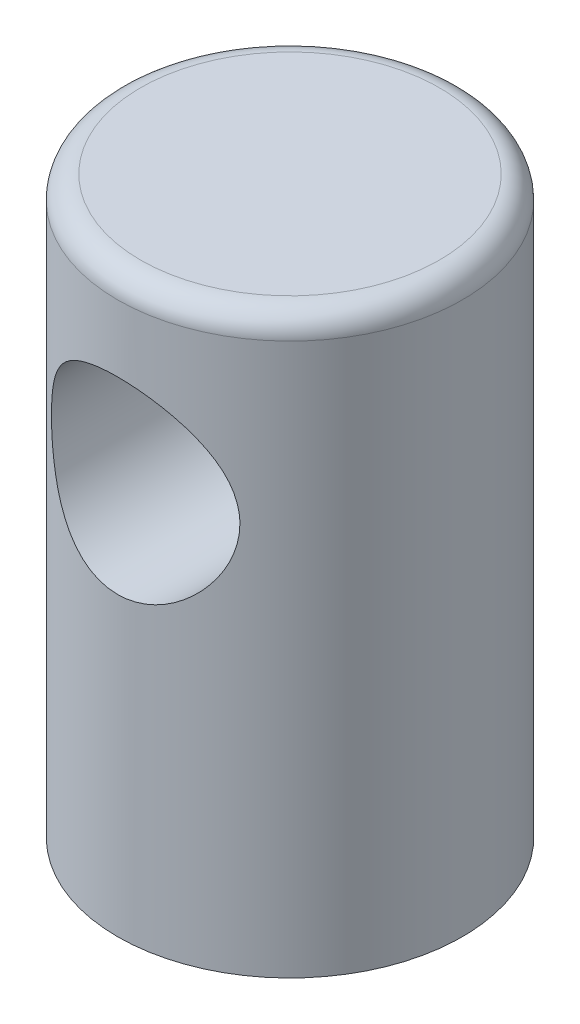
ISO-10303-21;
HEADER;
FILE_DESCRIPTION(('STEP AP214'),'2;1');
FILE_NAME('part.step','',(''),(''),'','','');
FILE_SCHEMA(('AUTOMOTIVE_DESIGN { 1 0 10303 214 1 1 1 1 }'));
ENDSEC;
DATA;
#1=APPLICATION_CONTEXT('core data for automotive mechanical design processes');
#2=APPLICATION_PROTOCOL_DEFINITION('international standard','automotive_design',2000,#1);
#3=PRODUCT_CONTEXT('',#1,'mechanical');
#4=PRODUCT('Part','Part','',(#3));
#5=PRODUCT_RELATED_PRODUCT_CATEGORY('part','',(#4));
#6=PRODUCT_DEFINITION_FORMATION('','',#4);
#7=PRODUCT_DEFINITION_CONTEXT('part definition',#1,'design');
#8=PRODUCT_DEFINITION('design','',#6,#7);
#9=PRODUCT_DEFINITION_SHAPE('','',#8);
#10=(LENGTH_UNIT() NAMED_UNIT(*) SI_UNIT(.MILLI.,.METRE.));
#11=(NAMED_UNIT(*) PLANE_ANGLE_UNIT() SI_UNIT($,.RADIAN.));
#12=(NAMED_UNIT(*) SI_UNIT($,.STERADIAN.) SOLID_ANGLE_UNIT());
#13=UNCERTAINTY_MEASURE_WITH_UNIT(LENGTH_MEASURE(1.E-05),#10,'distance_accuracy_value','');
#14=(GEOMETRIC_REPRESENTATION_CONTEXT(3) GLOBAL_UNCERTAINTY_ASSIGNED_CONTEXT((#13)) GLOBAL_UNIT_ASSIGNED_CONTEXT((#10,
#11,#12)) REPRESENTATION_CONTEXT('',''));
#15=CARTESIAN_POINT('',(0.,0.,0.));
#16=DIRECTION('',(0.,0.,1.));
#17=DIRECTION('',(1.,0.,0.));
#18=AXIS2_PLACEMENT_3D('',#15,#16,#17);
#19=CARTESIAN_POINT('',(0.,25.,0.));
#20=DIRECTION('',(0.,-1.,0.));
#21=DIRECTION('',(0.,0.,-1.));
#22=AXIS2_PLACEMENT_3D('',#19,#20,#21);
#23=CYLINDRICAL_SURFACE('',#22,7.5);
#24=CARTESIAN_POINT('',(0.,21.1,-7.5));
#25=CARTESIAN_POINT('',(-0.106573934645957,21.1000009084265,-7.50000081273061));
#26=CARTESIAN_POINT('',(-0.21313643870769,21.0958405152783,-7.49772377945524));
#27=CARTESIAN_POINT('',(-0.42545927593668,21.0792555400362,-7.48867657263857));
#28=CARTESIAN_POINT('',(-0.531219354622428,21.0668284386434,-7.48190502938608));
#29=CARTESIAN_POINT('',(-0.741201686015011,21.0338471322813,-7.46402902384523));
#30=CARTESIAN_POINT('',(-0.845422314838075,21.0132849039522,-7.45292028409107));
#31=CARTESIAN_POINT('',(-1.05149054209101,20.9642912711127,-7.42665368948545));
#32=CARTESIAN_POINT('',(-1.15333715280993,20.9358566524836,-7.41149418088507));
#33=CARTESIAN_POINT('',(-1.45336228932745,20.8394833617792,-7.36061207090714));
#34=CARTESIAN_POINT('',(-1.6471315139373,20.7602977559572,-7.31938607661403));
#35=CARTESIAN_POINT('',(-2.01814422803057,20.5749427815982,-7.22591398036082));
#36=CARTESIAN_POINT('',(-2.19538713348771,20.4687724599376,-7.17366748915825));
#37=CARTESIAN_POINT('',(-2.54206643368703,20.2242630954792,-7.05857316252065));
#38=CARTESIAN_POINT('',(-2.71014419755537,20.0842229595317,-6.99524512804682));
#39=CARTESIAN_POINT('',(-3.02169124467197,19.7797400914424,-6.86643091048839));
#40=CARTESIAN_POINT('',(-3.16513781608967,19.6152750954988,-6.800942801263));
#41=CARTESIAN_POINT('',(-3.43749462557373,19.2474062808724,-6.66774081052148));
#42=CARTESIAN_POINT('',(-3.5636437797434,19.0417726201787,-6.60042754580275));
#43=CARTESIAN_POINT('',(-3.72514523092172,18.716961963344,-6.50977160683407));
#44=CARTESIAN_POINT('',(-3.77437025724054,18.6059259575621,-6.48126429955823));
#45=CARTESIAN_POINT('',(-3.86304843332249,18.3790088454147,-6.42880292543978));
#46=CARTESIAN_POINT('',(-3.90250787075144,18.2631309130482,-6.40484593115852));
#47=CARTESIAN_POINT('',(-3.9689544618329,18.0347243603468,-6.36386921736729));
#48=CARTESIAN_POINT('',(-3.99656655992672,17.9224384145173,-6.34650972759967));
#49=CARTESIAN_POINT('',(-4.04227688695904,17.6952748011341,-6.31749422245027));
#50=CARTESIAN_POINT('',(-4.06038068766294,17.5803986926457,-6.30583486712543));
#51=CARTESIAN_POINT('',(-4.0867604515431,17.3491664046681,-6.28877077393339));
#52=CARTESIAN_POINT('',(-4.09504554900184,17.2328117027396,-6.2833602229594));
#53=CARTESIAN_POINT('',(-4.10165713604334,16.9997073154125,-6.27904659698444));
#54=CARTESIAN_POINT('',(-4.09998495517393,16.8829576848274,-6.28014265318722));
#55=CARTESIAN_POINT('',(-4.08771668911804,16.6677677411385,-6.28813268276836));
#56=CARTESIAN_POINT('',(-4.07849929834302,16.5692123114394,-6.29413069222198));
#57=CARTESIAN_POINT('',(-4.0530370510353,16.3733773579762,-6.31055560290412));
#58=CARTESIAN_POINT('',(-4.03679005130766,16.27609823266,-6.32098385481227));
#59=CARTESIAN_POINT('',(-3.97777985856741,15.9871688124785,-6.35841973299225));
#60=CARTESIAN_POINT('',(-3.92474025260353,15.7983052205248,-6.39158364896371));
#61=CARTESIAN_POINT('',(-3.79209359792903,15.4285201323808,-6.47117168971868));
#62=CARTESIAN_POINT('',(-3.71193334073884,15.2478610259368,-6.51786875836482));
#63=CARTESIAN_POINT('',(-3.52777152787463,14.9015970095795,-6.6193559642557));
#64=CARTESIAN_POINT('',(-3.42375961453357,14.7359986836239,-6.67414961378263));
#65=CARTESIAN_POINT('',(-3.17609370087732,14.3974972653392,-6.79590344199827));
#66=CARTESIAN_POINT('',(-3.02878986127582,14.2274656991037,-6.86343023779544));
#67=CARTESIAN_POINT('',(-2.70769830740109,13.9131227758866,-6.99632096513092));
#68=CARTESIAN_POINT('',(-2.5338930199075,13.7688286242763,-7.06168342622426));
#69=CARTESIAN_POINT('',(-2.2497152261565,13.5702265169763,-7.15539417267725));
#70=CARTESIAN_POINT('',(-2.14758376702382,13.5053454815625,-7.18678317121193));
#71=CARTESIAN_POINT('',(-1.93727667547434,13.3845268698248,-7.24630087847473));
#72=CARTESIAN_POINT('',(-1.82910365097962,13.3285854742415,-7.27443097807352));
#73=CARTESIAN_POINT('',(-1.60744280854174,13.2262719186545,-7.32660146651892));
#74=CARTESIAN_POINT('',(-1.49395766278402,13.1798950095172,-7.35064388400968));
#75=CARTESIAN_POINT('',(-1.26246903380229,13.0972744298367,-7.39391822780208));
#76=CARTESIAN_POINT('',(-1.14446618750206,13.0610293368068,-7.4131508293523));
#77=CARTESIAN_POINT('',(-0.916038618776326,13.0020663425066,-7.44465668014707));
#78=CARTESIAN_POINT('',(-0.805922289220479,12.9784074381309,-7.45740904070198));
#79=CARTESIAN_POINT('',(-0.583678307633231,12.9401935380569,-7.47808593544327));
#80=CARTESIAN_POINT('',(-0.471550883834909,12.9256375159407,-7.4860110139391));
#81=CARTESIAN_POINT('',(-0.246289701471043,12.905843346615,-7.49680263716242));
#82=CARTESIAN_POINT('',(-0.133156471867724,12.9006005627182,-7.49967169907183));
#83=CARTESIAN_POINT('',(0.0931645265132909,12.8994969595474,-7.50027498897887));
#84=CARTESIAN_POINT('',(0.20635229139722,12.9036355480345,-7.49800954111423));
#85=CARTESIAN_POINT('',(0.420883852265761,12.9203816672955,-7.48887452246084));
#86=CARTESIAN_POINT('',(0.522315283580152,12.9321322258077,-7.48247098770682));
#87=CARTESIAN_POINT('',(0.723709026069785,12.9630899592273,-7.46568687319145));
#88=CARTESIAN_POINT('',(0.823670870401515,12.9822994526701,-7.45530505683426));
#89=CARTESIAN_POINT('',(1.1202726387825,13.050814705433,-7.4185258095444));
#90=CARTESIAN_POINT('',(1.31382111277914,13.1110227010056,-7.38648575645142));
#91=CARTESIAN_POINT('',(1.69203293829092,13.2597658828877,-7.30925736325514));
#92=CARTESIAN_POINT('',(1.87638964891696,13.3489205950182,-7.26378363004543));
#93=CARTESIAN_POINT('',(2.22804519050804,13.5522333954873,-7.16374611925089));
#94=CARTESIAN_POINT('',(2.39533766397102,13.666400753106,-7.10917897359429));
#95=CARTESIAN_POINT('',(2.72788444224418,13.9310142193291,-6.98879751170646));
#96=CARTESIAN_POINT('',(2.89084661006226,14.0840819197866,-6.92240718582408));
#97=CARTESIAN_POINT('',(3.18999655715162,14.4147048881482,-6.78975334645223));
#98=CARTESIAN_POINT('',(3.32615703363743,14.5922848165729,-6.72349002967776));
#99=CARTESIAN_POINT('',(3.5779773910981,14.983555235117,-6.59315512249784));
#100=CARTESIAN_POINT('',(3.6913102726195,15.1989605133091,-6.52962763278148));
#101=CARTESIAN_POINT('',(3.83206223254979,15.53704232929,-6.44734482529256));
#102=CARTESIAN_POINT('',(3.87410648960241,15.6522386184694,-6.42208426963096));
#103=CARTESIAN_POINT('',(3.94791669858315,15.8868767262061,-6.3769763697226));
#104=CARTESIAN_POINT('',(3.97968981351563,16.0063155212795,-6.35712525450336));
#105=CARTESIAN_POINT('',(4.02987677292,16.2367026524413,-6.3254159785764));
#106=CARTESIAN_POINT('',(4.04928574440992,16.3473543615919,-6.3129702987991));
#107=CARTESIAN_POINT('',(4.07897160313283,16.5703182837527,-6.2938307428021));
#108=CARTESIAN_POINT('',(4.08925363038747,16.6826295258834,-6.28713362923229));
#109=CARTESIAN_POINT('',(4.10051468051794,16.9078646555059,-6.27979499366913));
#110=CARTESIAN_POINT('',(4.10149791776983,17.0207882422511,-6.27915072841876));
#111=CARTESIAN_POINT('',(4.09415457213973,17.2461953992695,-6.28394125870003));
#112=CARTESIAN_POINT('',(4.08582872360662,17.3586790035485,-6.28937557472173));
#113=CARTESIAN_POINT('',(4.06174469156724,17.5672110689171,-6.30495065108804));
#114=CARTESIAN_POINT('',(4.04712758332972,17.6634482440443,-6.31436594760982));
#115=CARTESIAN_POINT('',(4.0112082194745,17.8541894256803,-6.33724359779072));
#116=CARTESIAN_POINT('',(3.98990381764242,17.9486928654448,-6.35070725066749));
#117=CARTESIAN_POINT('',(3.91629957455314,18.2287354062152,-6.39656008180941));
#118=CARTESIAN_POINT('',(3.85429487747422,18.4109234215033,-6.43442065527917));
#119=CARTESIAN_POINT('',(3.70210964456735,18.7735546530895,-6.52323236641775));
#120=CARTESIAN_POINT('',(3.61042068900943,18.9531895229154,-6.5748495271991));
#121=CARTESIAN_POINT('',(3.40288370714911,19.2957587536496,-6.68462110477707));
#122=CARTESIAN_POINT('',(3.28702279844064,19.4586841399209,-6.74277899979906));
#123=CARTESIAN_POINT('',(3.01363276757207,19.7894291386724,-6.86979620153756));
#124=CARTESIAN_POINT('',(2.85243217209656,19.954120759932,-6.93892141949679));
#125=CARTESIAN_POINT('',(2.50331464455675,20.2552250931335,-7.07235888995773));
#126=CARTESIAN_POINT('',(2.31537908497068,20.3916179236788,-7.13666773857178));
#127=CARTESIAN_POINT('',(2.01315638681485,20.5737501335376,-7.22556494181149));
#128=CARTESIAN_POINT('',(1.90714484403668,20.6314544743746,-7.25433481694938));
#129=CARTESIAN_POINT('',(1.68967428667309,20.7375951360165,-7.30804452739231));
#130=CARTESIAN_POINT('',(1.57821798059042,20.786036007174,-7.33298624195143));
#131=CARTESIAN_POINT('',(1.35084505163158,20.8729841519862,-7.37825401130925));
#132=CARTESIAN_POINT('',(1.2349375462314,20.9115106040874,-7.39858896815343));
#133=CARTESIAN_POINT('',(0.999458944027171,20.9781961289026,-7.43405989622318));
#134=CARTESIAN_POINT('',(0.879889824684756,21.0063606942321,-7.44919862157415));
#135=CARTESIAN_POINT('',(0.634386812688221,21.0526082642012,-7.47417164899619));
#136=CARTESIAN_POINT('',(0.508370471085667,21.0703522060321,-7.4838272462866));
#137=CARTESIAN_POINT('',(0.254897297231694,21.0940474849499,-7.49674091099307));
#138=CARTESIAN_POINT('',(0.127440476185957,21.099998913709,-7.49999902814158));
#139=CARTESIAN_POINT('',(0.,21.1,-7.5));
#140=B_SPLINE_CURVE_WITH_KNOTS('',3,(#24,#25,#26,#27,#28,#29,#30,#31,#32,#33,#34,#35,#36,#37,
#38,#39,#40,#41,#42,#43,#44,#45,#46,#47,#48,#49,#50,#51,#52,#53,#54,#55,#56,#57,#58,#59,#60,#61,
#62,#63,#64,#65,#66,#67,#68,#69,#70,#71,#72,#73,#74,#75,#76,#77,#78,#79,#80,#81,#82,#83,#84,#85,
#86,#87,#88,#89,#90,#91,#92,#93,#94,#95,#96,#97,#98,#99,#100,#101,#102,#103,#104,#105,#106,#107,
#108,#109,#110,#111,#112,#113,#114,#115,#116,#117,#118,#119,#120,#121,#122,#123,#124,#125,#126,
#127,#128,#129,#130,#131,#132,#133,#134,#135,#136,#137,#138,#139),.UNSPECIFIED.,.T.,.F.,(4,2,2,
2,2,2,2,2,2,2,2,2,2,2,2,2,2,2,2,2,2,2,2,2,2,2,2,2,2,2,2,2,2,2,2,2,2,2,2,2,2,2,2,2,2,2,2,2,2,2,2,
2,2,2,2,2,2,4),(0.,0.319596678541733,0.639290799577186,0.959301011673195,1.2794420698566,
1.91639516761656,2.55337076624139,3.23382448744707,3.9149023081272,4.66206671211769,
5.03589413847789,5.40948024267271,5.7597387557395,6.10979179123826,6.45951891816062,
6.80919934873634,7.10633553893022,7.40356238423946,7.9976559280753,8.60468221402115,
9.2119726041664,9.91374072303406,10.615976227406,10.9905581212694,11.3649795531434,
11.7392146204379,12.1133971194545,12.4529754185827,12.7925154208166,13.131886332293,
13.4712358201357,13.7777948862706,14.0844493196053,14.6971859502687,15.324011938395,
15.9510706121555,16.6478078226179,17.3452511646969,18.0954033698558,18.4705204505624,
18.8453753606971,19.1839614036863,19.5223566439579,19.8605985101693,20.1988136959938,
20.4918605797136,20.7850016099821,21.3709341102879,21.9931905299081,22.615779431209,
23.3344908881185,24.0537055807215,24.4255096872706,24.7971306863833,25.1680273247614,
25.538727074499,25.9209018497986,26.3030736541532),.UNSPECIFIED.);
#141=CARTESIAN_POINT('',(0.,21.1,-7.5));
#142=VERTEX_POINT('',#141);
#143=EDGE_CURVE('E11',#142,#142,#140,.T.);
#144=ORIENTED_EDGE('',*,*,#143,.T.);
#145=EDGE_LOOP('',(#144));
#146=FACE_BOUND('',#145,.T.);
#147=CARTESIAN_POINT('',(4.1,17.,6.28012738724303));
#148=CARTESIAN_POINT('',(4.10000093002348,16.8947668881671,6.28012612742238));
#149=CARTESIAN_POINT('',(4.09594359663583,16.789544471863,6.28278107655353));
#150=CARTESIAN_POINT('',(4.07978004523093,16.5799454707598,6.29328917379422));
#151=CARTESIAN_POINT('',(4.0676711131229,16.4755691831927,6.30114407473698));
#152=CARTESIAN_POINT('',(4.03556208672876,16.2684006736593,6.32175621425818));
#153=CARTESIAN_POINT('',(4.01555240256419,16.1656105350895,6.33451940999906));
#154=CARTESIAN_POINT('',(3.96792069657193,15.962450018736,6.36446311913343));
#155=CARTESIAN_POINT('',(3.94029527548137,15.8620807433044,6.38164560483449));
#156=CARTESIAN_POINT('',(3.84688424959316,15.5668846935001,6.43869656140272));
#157=CARTESIAN_POINT('',(3.77032160656169,15.3764480139658,6.48423444926833));
#158=CARTESIAN_POINT('',(3.59117414567328,15.0112977961189,6.58513356407885));
#159=CARTESIAN_POINT('',(3.48858413072552,14.8365874074494,6.64049675225485));
#160=CARTESIAN_POINT('',(3.24832878098852,14.4885428832786,6.76152426532025));
#161=CARTESIAN_POINT('',(3.10818539837053,14.317084561435,6.82766525826985));
#162=CARTESIAN_POINT('',(2.80180008146181,13.9985446210087,6.95899755732466));
#163=CARTESIAN_POINT('',(2.63554282752463,13.8514774162023,7.02418828126847));
#164=CARTESIAN_POINT('',(2.36132120773385,13.6460902265034,7.11931441764812));
#165=CARTESIAN_POINT('',(2.26144791580563,13.5779316301487,7.15174434363931));
#166=CARTESIAN_POINT('',(2.0554148745458,13.4503615729961,7.21365490826196));
#167=CARTESIAN_POINT('',(1.94925770322166,13.3909465594797,7.24313674320122));
#168=CARTESIAN_POINT('',(1.73132104263363,13.2814794830552,7.29829854016738));
#169=CARTESIAN_POINT('',(1.61954346052907,13.231424270955,7.32397978033098));
#170=CARTESIAN_POINT('',(1.39112250354381,13.1412635907747,7.37077746349993));
#171=CARTESIAN_POINT('',(1.27447976908253,13.1011568179402,7.39189450506083));
#172=CARTESIAN_POINT('',(1.04705225639775,13.0343284352602,7.42736951287102));
#173=CARTESIAN_POINT('',(0.936575549191747,13.0067768173747,7.44214075011331));
#174=CARTESIAN_POINT('',(0.713197049439393,12.9608978422434,7.46685822279571));
#175=CARTESIAN_POINT('',(0.600295549311174,12.9425693791711,7.47680503666349));
#176=CARTESIAN_POINT('',(0.373089778895296,12.9154086968346,7.49157901174382));
#177=CARTESIAN_POINT('',(0.258786378935841,12.906570860242,7.49640920136975));
#178=CARTESIAN_POINT('',(0.0297451936071894,12.8985069600318,7.50081552628574));
#179=CARTESIAN_POINT('',(-0.0849925572451534,12.8992801480382,7.5003920706583));
#180=CARTESIAN_POINT('',(-0.301973410365606,12.9098469342542,7.49462039538139));
#181=CARTESIAN_POINT('',(-0.40427722763431,12.9186958876674,7.48978792630472));
#182=CARTESIAN_POINT('',(-0.607673169264992,12.9439853644267,7.47603835925916));
#183=CARTESIAN_POINT('',(-0.708764907864702,12.9604282421298,7.46711999454001));
#184=CARTESIAN_POINT('',(-1.00909210964698,13.0208888185037,7.43452185683212));
#185=CARTESIAN_POINT('',(-1.20558214800269,13.0760487591009,7.40499307451031));
#186=CARTESIAN_POINT('',(-1.58807689391617,13.2145105209361,7.33256019619329));
#187=CARTESIAN_POINT('',(-1.77394206831017,13.2981159905432,7.28951218461427));
#188=CARTESIAN_POINT('',(-2.12940164615156,13.4905105022637,7.19371631807302));
#189=CARTESIAN_POINT('',(-2.298990765565,13.5993076840286,7.14096532913332));
#190=CARTESIAN_POINT('',(-2.6364597751998,13.8522736653664,7.02383812157043));
#191=CARTESIAN_POINT('',(-2.80221477080394,13.998981730383,6.95882194607267));
#192=CARTESIAN_POINT('',(-3.10800752779965,14.3168936589683,6.82773935603272));
#193=CARTESIAN_POINT('',(-3.24801896018513,14.4881222859421,6.76167194053228));
#194=CARTESIAN_POINT('',(-3.51042960397764,14.8682032370832,6.62950129175416));
#195=CARTESIAN_POINT('',(-3.6302765150503,15.0790252082404,6.5638841901));
#196=CARTESIAN_POINT('',(-3.78151167047837,15.4109757554452,6.4771567152707));
#197=CARTESIAN_POINT('',(-3.82717306027364,15.524266922624,6.45019352693943));
#198=CARTESIAN_POINT('',(-3.90844971616798,15.7554131883302,6.40127099147903));
#199=CARTESIAN_POINT('',(-3.94407175251152,15.8732651499012,6.3793082741091));
#200=CARTESIAN_POINT('',(-4.00228205551416,16.1029862264195,6.34293480689148));
#201=CARTESIAN_POINT('',(-4.0256876853828,16.2145750544872,6.32805900639557));
#202=CARTESIAN_POINT('',(-4.06316133846621,16.4398687480593,6.30406359751327));
#203=CARTESIAN_POINT('',(-4.07723473963101,16.5535723559548,6.29494067402429));
#204=CARTESIAN_POINT('',(-4.09580313362994,16.7820091554196,6.28287519043653));
#205=CARTESIAN_POINT('',(-4.10030472440854,16.896741582995,6.2799283731062));
#206=CARTESIAN_POINT('',(-4.09966329441545,17.1261601791551,6.28034728091182));
#207=CARTESIAN_POINT('',(-4.09452129040506,17.2408463513415,6.28371234056228));
#208=CARTESIAN_POINT('',(-4.07611387812923,17.4526873481902,6.29566464834979));
#209=CARTESIAN_POINT('',(-4.06411678345451,17.5500015195397,6.30343533291544));
#210=CARTESIAN_POINT('',(-4.03328116882656,17.743113483076,6.32320897197404));
#211=CARTESIAN_POINT('',(-4.01444056463844,17.8389108040104,6.33521321579232));
#212=CARTESIAN_POINT('',(-3.94796393674734,18.1231036661807,6.37701912464347));
#213=CARTESIAN_POINT('',(-3.89036264928045,18.3084166712026,6.41262127203169));
#214=CARTESIAN_POINT('',(-3.74789075804152,18.6743940548848,6.49695236128483));
#215=CARTESIAN_POINT('',(-3.66196201160869,18.8545231869117,6.54617634763405));
#216=CARTESIAN_POINT('',(-3.46612605894499,19.1989149175086,6.65194323265548));
#217=CARTESIAN_POINT('',(-3.35620690614238,19.3631695520017,6.70848977203471));
#218=CARTESIAN_POINT('',(-3.09559068918958,19.6979825425018,6.83310328053067));
#219=CARTESIAN_POINT('',(-2.94120628272147,19.8655201587125,6.90159039037849));
#220=CARTESIAN_POINT('',(-2.60581370531332,20.1735666243641,7.03507237963437));
#221=CARTESIAN_POINT('',(-2.42479051868261,20.3140601258669,7.10006526102639));
#222=CARTESIAN_POINT('',(-2.13128973330499,20.5045884149107,7.19158270694288));
#223=CARTESIAN_POINT('',(-2.02709544360212,20.565892616739,7.22171590411666));
#224=CARTESIAN_POINT('',(-1.81295038072508,20.6793850234505,7.27842368452693));
#225=CARTESIAN_POINT('',(-1.70300221025168,20.7315773044632,7.30499985771567));
#226=CARTESIAN_POINT('',(-1.47813750866814,20.826223308148,7.35379784598398));
#227=CARTESIAN_POINT('',(-1.36322391661016,20.8686827003965,7.37602219497108));
#228=CARTESIAN_POINT('',(-1.1292696660947,20.9433257316567,7.41544411987379));
#229=CARTESIAN_POINT('',(-1.01022961514595,20.9755108762085,7.43264243225012));
#230=CARTESIAN_POINT('',(-0.781309283939384,21.0263979016229,7.45999126243726));
#231=CARTESIAN_POINT('',(-0.671722471450188,21.0461352702138,7.4706791905375));
#232=CARTESIAN_POINT('',(-0.450952457388738,21.0766475660378,7.4872485070153));
#233=CARTESIAN_POINT('',(-0.339769423200745,21.087423426117,7.49313039567517));
#234=CARTESIAN_POINT('',(-0.116788922555516,21.0998566154682,7.49991981037215));
#235=CARTESIAN_POINT('',(-0.00499172787698844,21.1015176966487,7.50082938315862));
#236=CARTESIAN_POINT('',(0.218289340182127,21.0957076954327,7.49765401112425));
#237=CARTESIAN_POINT('',(0.329773228402518,21.0882370531256,7.49356930699491));
#238=CARTESIAN_POINT('',(0.54171397419397,21.0653269919574,7.48109615888561));
#239=CARTESIAN_POINT('',(0.642277817796815,21.0506467444451,7.47311811186246));
#240=CARTESIAN_POINT('',(0.841684168592674,21.0139584432549,7.45329662302537));
#241=CARTESIAN_POINT('',(0.94052608689259,20.9919479324836,7.44145188512872));
#242=CARTESIAN_POINT('',(1.23343370905106,20.9152628420748,7.40049763244363));
#243=CARTESIAN_POINT('',(1.4240672015353,20.849914132836,7.3659564392259));
#244=CARTESIAN_POINT('',(1.79796896182169,20.6905459199052,7.28390818412237));
#245=CARTESIAN_POINT('',(1.9807471039562,20.5956043682419,7.23599023287566));
#246=CARTESIAN_POINT('',(2.32842345037957,20.3808595743306,7.13171832343038));
#247=CARTESIAN_POINT('',(2.49331427634939,20.2610461316293,7.07536090669103));
#248=CARTESIAN_POINT('',(2.82044367231791,19.9843137755529,6.95191016757063));
#249=CARTESIAN_POINT('',(2.98023260127396,19.8247208749107,6.88432560260033));
#250=CARTESIAN_POINT('',(3.27202524234999,19.4808678585942,6.75052943533091));
#251=CARTESIAN_POINT('',(3.40399572392511,19.2965786667946,6.68431955928908));
#252=CARTESIAN_POINT('',(3.58226986388828,18.9979895233902,6.58955885008802));
#253=CARTESIAN_POINT('',(3.63978404032126,18.8912356226072,6.55787026364499));
#254=CARTESIAN_POINT('',(3.74544459054407,18.6722455526301,6.49810147641243));
#255=CARTESIAN_POINT('',(3.7935957207368,18.5600122034256,6.47001944597667));
#256=CARTESIAN_POINT('',(3.87986448249383,18.3310098638205,6.41865808488848));
#257=CARTESIAN_POINT('',(3.91800633909213,18.214252624126,6.39536718856734));
#258=CARTESIAN_POINT('',(3.98381964996947,17.9768991399735,6.35457971515488));
#259=CARTESIAN_POINT('',(4.01149783646695,17.8563054182095,6.33707941336162));
#260=CARTESIAN_POINT('',(4.05564876993584,17.6137788624584,6.30891385116337));
#261=CARTESIAN_POINT('',(4.07224994506697,17.4918786444266,6.29817033878415));
#262=CARTESIAN_POINT('',(4.09442497855366,17.2466473821928,6.28377786854182));
#263=CARTESIAN_POINT('',(4.09999891016149,17.1233163475009,6.280128863551));
#264=CARTESIAN_POINT('',(4.1,17.,6.28012738724303));
#265=B_SPLINE_CURVE_WITH_KNOTS('',3,(#147,#148,#149,#150,#151,#152,#153,#154,#155,#156,#157,
#158,#159,#160,#161,#162,#163,#164,#165,#166,#167,#168,#169,#170,#171,#172,#173,#174,#175,#176,
#177,#178,#179,#180,#181,#182,#183,#184,#185,#186,#187,#188,#189,#190,#191,#192,#193,#194,#195,
#196,#197,#198,#199,#200,#201,#202,#203,#204,#205,#206,#207,#208,#209,#210,#211,#212,#213,#214,
#215,#216,#217,#218,#219,#220,#221,#222,#223,#224,#225,#226,#227,#228,#229,#230,#231,#232,#233,
#234,#235,#236,#237,#238,#239,#240,#241,#242,#243,#244,#245,#246,#247,#248,#249,#250,#251,#252,
#253,#254,#255,#256,#257,#258,#259,#260,#261,#262,#263,#264),.UNSPECIFIED.,.T.,.F.,(4,2,2,2,2,2,
2,2,2,2,2,2,2,2,2,2,2,2,2,2,2,2,2,2,2,2,2,2,2,2,2,2,2,2,2,2,2,2,2,2,2,2,2,2,2,2,2,2,2,2,2,2,2,2,
2,2,2,2,4),(0.,0.315569981779387,0.631246392120128,0.947307152048526,1.26350921386151,
1.89132317968482,2.51926260488014,3.20984164145282,3.90082732837244,4.27597161219806,
4.6509630429027,5.02582807633552,5.40064391956258,5.7446088863778,6.08853260306956,
6.4322526452119,6.7759459232758,7.08396400568569,7.39207764763421,8.00770382432461,
8.63011931132165,9.25273618725917,9.941979315332,10.6319234867404,11.3812380111004,
11.7560276123415,12.1305638584022,12.4750020152507,12.8192415073645,13.1632436347321,
13.5072094946701,13.8019338198038,14.0967479804927,14.6860287732841,15.3004393437246,
15.9151565748992,16.6258629170212,17.3369714140815,17.7103095162913,18.0834801789773,
18.4564329077225,18.8293309606017,19.1644594163236,19.4995529825685,19.8345086041948,
20.1694480837857,20.474910495087,20.7804754001679,21.3910497661197,22.0229593318396,
22.6551285699663,23.3594335959906,24.0645752411134,24.4401426697591,24.8155188098343,
25.1899778839793,25.5641956232932,25.9339955404923,26.3037930011598),.UNSPECIFIED.);
#266=CARTESIAN_POINT('',(4.1,17.,6.28012738724303));
#267=VERTEX_POINT('',#266);
#268=EDGE_CURVE('E49',#267,#267,#265,.T.);
#269=ORIENTED_EDGE('',*,*,#268,.T.);
#270=EDGE_LOOP('',(#269));
#271=FACE_BOUND('',#270,.T.);
#272=CARTESIAN_POINT('',(0.,24.,0.));
#273=DIRECTION('',(0.,1.,0.));
#274=DIRECTION('',(0.,0.,1.));
#275=AXIS2_PLACEMENT_3D('',#272,#273,#274);
#276=CIRCLE('',#275,7.5);
#277=CARTESIAN_POINT('',(0.,24.,7.5));
#278=VERTEX_POINT('',#277);
#279=EDGE_CURVE('E73',#278,#278,#276,.F.);
#280=ORIENTED_EDGE('',*,*,#279,.T.);
#281=EDGE_LOOP('',(#280));
#282=FACE_BOUND('',#281,.T.);
#283=CARTESIAN_POINT('',(0.,0.,0.));
#284=DIRECTION('',(0.,1.,0.));
#285=DIRECTION('',(0.,0.,1.));
#286=AXIS2_PLACEMENT_3D('',#283,#284,#285);
#287=CIRCLE('',#286,7.5);
#288=CARTESIAN_POINT('',(0.,0.,7.5));
#289=VERTEX_POINT('',#288);
#290=EDGE_CURVE('E62',#289,#289,#287,.T.);
#291=ORIENTED_EDGE('',*,*,#290,.T.);
#292=EDGE_LOOP('',(#291));
#293=FACE_BOUND('',#292,.T.);
#294=ADVANCED_FACE('F38',(#146,#271,#282,#293),#23,.T.);
#295=CARTESIAN_POINT('',(0.,25.,0.));
#296=DIRECTION('',(0.,1.,0.));
#297=DIRECTION('',(0.,0.,1.));
#298=AXIS2_PLACEMENT_3D('',#295,#296,#297);
#299=PLANE('',#298);
#300=CARTESIAN_POINT('',(0.,25.,0.));
#301=DIRECTION('',(0.,1.,0.));
#302=DIRECTION('',(0.,0.,1.));
#303=AXIS2_PLACEMENT_3D('',#300,#301,#302);
#304=CIRCLE('',#303,6.5);
#305=CARTESIAN_POINT('',(0.,25.,6.5));
#306=VERTEX_POINT('',#305);
#307=EDGE_CURVE('E66',#306,#306,#304,.T.);
#308=ORIENTED_EDGE('',*,*,#307,.T.);
#309=EDGE_LOOP('',(#308));
#310=FACE_BOUND('',#309,.T.);
#311=ADVANCED_FACE('F86',(#310),#299,.T.);
#312=CARTESIAN_POINT('',(0.,0.,0.));
#313=DIRECTION('',(0.,1.,0.));
#314=DIRECTION('',(0.,0.,1.));
#315=AXIS2_PLACEMENT_3D('',#312,#313,#314);
#316=PLANE('',#315);
#317=CARTESIAN_POINT('',(0.,0.,0.));
#318=DIRECTION('',(0.,-1.,0.));
#319=DIRECTION('',(0.,0.,-1.));
#320=AXIS2_PLACEMENT_3D('',#317,#318,#319);
#321=CIRCLE('',#320,2.09999999999999);
#322=CARTESIAN_POINT('',(0.,0.,-2.09999999999999));
#323=VERTEX_POINT('',#322);
#324=EDGE_CURVE('E63',#323,#323,#321,.T.);
#325=ORIENTED_EDGE('',*,*,#324,.F.);
#326=EDGE_LOOP('',(#325));
#327=FACE_BOUND('',#326,.T.);
#328=ORIENTED_EDGE('',*,*,#290,.F.);
#329=EDGE_LOOP('',(#328));
#330=FACE_BOUND('',#329,.T.);
#331=ADVANCED_FACE('F89',(#327,#330),#316,.F.);
#332=CARTESIAN_POINT('',(0.,24.,0.));
#333=DIRECTION('',(0.,1.,0.));
#334=DIRECTION('',(0.,0.,1.));
#335=AXIS2_PLACEMENT_3D('',#332,#333,#334);
#336=TOROIDAL_SURFACE('',#335,6.5,1.);
#337=ORIENTED_EDGE('',*,*,#279,.F.);
#338=EDGE_LOOP('',(#337));
#339=FACE_BOUND('',#338,.T.);
#340=ORIENTED_EDGE('',*,*,#307,.F.);
#341=EDGE_LOOP('',(#340));
#342=FACE_BOUND('',#341,.T.);
#343=ADVANCED_FACE('F40',(#339,#342),#336,.T.);
#344=CARTESIAN_POINT('',(0.,17.,-7.5));
#345=DIRECTION('',(0.,0.,1.));
#346=DIRECTION('',(1.,0.,0.));
#347=AXIS2_PLACEMENT_3D('',#344,#345,#346);
#348=CYLINDRICAL_SURFACE('',#347,4.1);
#349=ORIENTED_EDGE('',*,*,#268,.F.);
#350=EDGE_LOOP('',(#349));
#351=FACE_BOUND('',#350,.T.);
#352=ORIENTED_EDGE('',*,*,#143,.F.);
#353=EDGE_LOOP('',(#352));
#354=FACE_BOUND('',#353,.T.);
#355=ADVANCED_FACE('F56',(#351,#354),#348,.F.);
#356=CARTESIAN_POINT('',(0.,11.,0.));
#357=DIRECTION('',(0.,-1.,0.));
#358=DIRECTION('',(0.,0.,-1.));
#359=AXIS2_PLACEMENT_3D('',#356,#357,#358);
#360=CONICAL_SURFACE('',#359,2.1,1.02974425867665);
#361=CARTESIAN_POINT('',(0.,12.2618072999579,0.));
#362=VERTEX_POINT('',#361);
#363=VERTEX_LOOP('',#362);
#364=FACE_BOUND('',#363,.T.);
#365=CARTESIAN_POINT('',(0.,11.,0.));
#366=DIRECTION('',(0.,-1.,0.));
#367=DIRECTION('',(0.,0.,-1.));
#368=AXIS2_PLACEMENT_3D('',#365,#366,#367);
#369=CIRCLE('',#368,2.1);
#370=CARTESIAN_POINT('',(0.,11.,-2.1));
#371=VERTEX_POINT('',#370);
#372=EDGE_CURVE('E60',#371,#371,#369,.T.);
#373=ORIENTED_EDGE('',*,*,#372,.T.);
#374=EDGE_LOOP('',(#373));
#375=FACE_BOUND('',#374,.T.);
#376=ADVANCED_FACE('F52',(#364,#375),#360,.F.);
#377=CARTESIAN_POINT('',(0.,0.,0.));
#378=DIRECTION('',(0.,-1.,0.));
#379=DIRECTION('',(0.,0.,-1.));
#380=AXIS2_PLACEMENT_3D('',#377,#378,#379);
#381=CYLINDRICAL_SURFACE('',#380,2.09999999999999);
#382=ORIENTED_EDGE('',*,*,#372,.F.);
#383=EDGE_LOOP('',(#382));
#384=FACE_BOUND('',#383,.T.);
#385=ORIENTED_EDGE('',*,*,#324,.T.);
#386=EDGE_LOOP('',(#385));
#387=FACE_BOUND('',#386,.T.);
#388=ADVANCED_FACE('F55',(#384,#387),#381,.F.);
#389=CLOSED_SHELL('',(#294,#311,#331,#343,#355,#376,#388));
#390=MANIFOLD_SOLID_BREP('B2',#389);
#391=ADVANCED_BREP_SHAPE_REPRESENTATION('',(#18,#390),#14);
#392=SHAPE_DEFINITION_REPRESENTATION(#9,#391);
ENDSEC;
END-ISO-10303-21;
